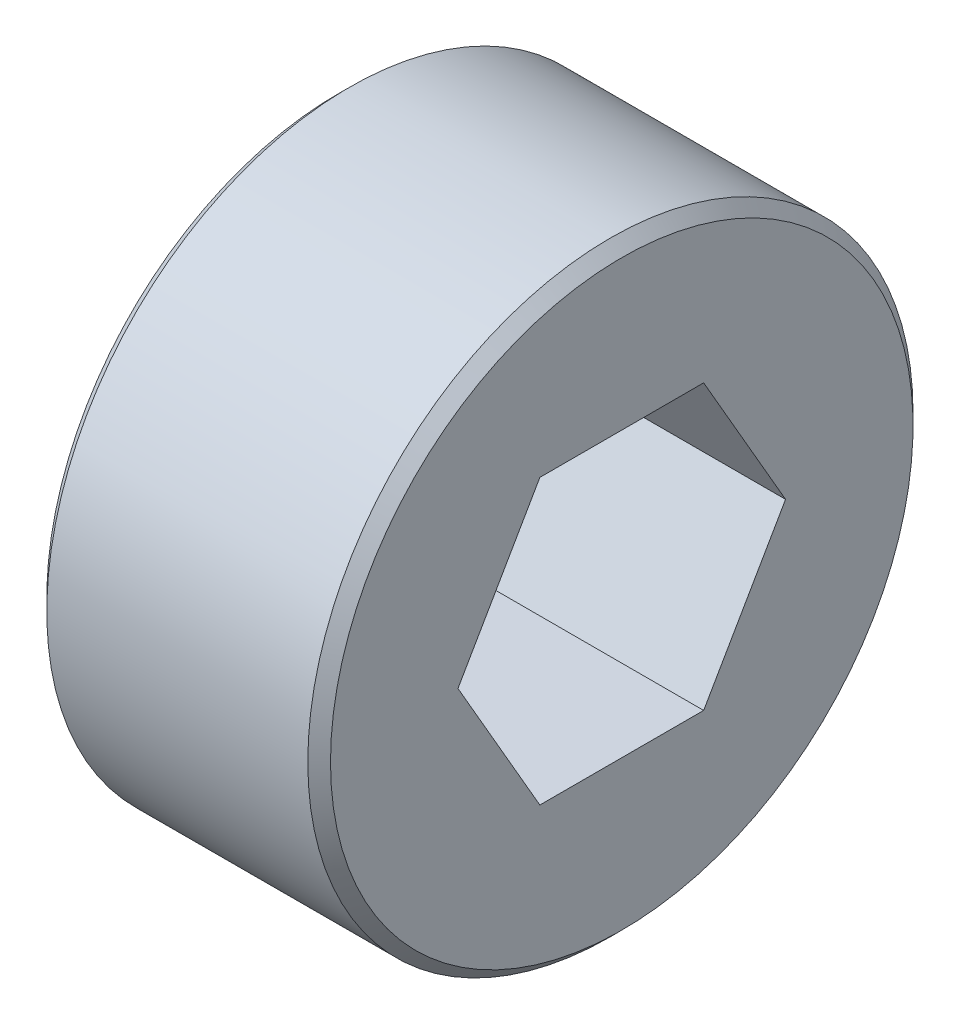
ISO-10303-21;
HEADER;
FILE_DESCRIPTION(('STEP AP214'),'2;1');
FILE_NAME('part.step','',(''),(''),'','','');
FILE_SCHEMA(('AUTOMOTIVE_DESIGN { 1 0 10303 214 1 1 1 1 }'));
ENDSEC;
DATA;
#1=APPLICATION_CONTEXT('core data for automotive mechanical design processes');
#2=APPLICATION_PROTOCOL_DEFINITION('international standard','automotive_design',2000,#1);
#3=PRODUCT_CONTEXT('',#1,'mechanical');
#4=PRODUCT('Part','Part','',(#3));
#5=PRODUCT_RELATED_PRODUCT_CATEGORY('part','',(#4));
#6=PRODUCT_DEFINITION_FORMATION('','',#4);
#7=PRODUCT_DEFINITION_CONTEXT('part definition',#1,'design');
#8=PRODUCT_DEFINITION('design','',#6,#7);
#9=PRODUCT_DEFINITION_SHAPE('','',#8);
#10=(LENGTH_UNIT() NAMED_UNIT(*) SI_UNIT(.MILLI.,.METRE.));
#11=(NAMED_UNIT(*) PLANE_ANGLE_UNIT() SI_UNIT($,.RADIAN.));
#12=(NAMED_UNIT(*) SI_UNIT($,.STERADIAN.) SOLID_ANGLE_UNIT());
#13=UNCERTAINTY_MEASURE_WITH_UNIT(LENGTH_MEASURE(1.E-05),#10,'distance_accuracy_value','');
#14=(GEOMETRIC_REPRESENTATION_CONTEXT(3) GLOBAL_UNCERTAINTY_ASSIGNED_CONTEXT((#13)) GLOBAL_UNIT_ASSIGNED_CONTEXT((#10,
#11,#12)) REPRESENTATION_CONTEXT('',''));
#15=CARTESIAN_POINT('',(0.,0.,0.));
#16=DIRECTION('',(0.,0.,1.));
#17=DIRECTION('',(1.,0.,0.));
#18=AXIS2_PLACEMENT_3D('',#15,#16,#17);
#19=CARTESIAN_POINT('',(790.078206956139,300.194333300496,0.));
#20=DIRECTION('',(1.,0.,0.));
#21=DIRECTION('',(0.,0.,-1.));
#22=AXIS2_PLACEMENT_3D('',#19,#20,#21);
#23=CONICAL_SURFACE('',#22,6.34999999987001,0.785398162502276);
#24=CARTESIAN_POINT('',(790.078206956082,300.194333300496,0.));
#25=DIRECTION('',(1.,0.,0.));
#26=DIRECTION('',(0.,0.,-1.));
#27=AXIS2_PLACEMENT_3D('',#24,#25,#26);
#28=CIRCLE('',#27,6.35000000000003);
#29=CARTESIAN_POINT('',(790.078206956082,300.194333300496,-6.35000000000003));
#30=VERTEX_POINT('',#29);
#31=EDGE_CURVE('E103',#30,#30,#28,.T.);
#32=ORIENTED_EDGE('',*,*,#31,.F.);
#33=EDGE_LOOP('',(#32));
#34=FACE_BOUND('',#33,.T.);
#35=CARTESIAN_POINT('',(789.824206955927,300.194333300496,0.));
#36=DIRECTION('',(1.,0.,0.));
#37=DIRECTION('',(0.,0.,-1.));
#38=AXIS2_PLACEMENT_3D('',#35,#36,#37);
#39=CIRCLE('',#38,6.0960000001134);
#40=CARTESIAN_POINT('',(789.824206955927,300.194333300496,-6.0960000001134));
#41=VERTEX_POINT('',#40);
#42=EDGE_CURVE('E21',#41,#41,#39,.F.);
#43=ORIENTED_EDGE('',*,*,#42,.F.);
#44=EDGE_LOOP('',(#43));
#45=FACE_BOUND('',#44,.T.);
#46=ADVANCED_FACE('F17',(#34,#45),#23,.T.);
#47=CARTESIAN_POINT('',(790.141706956082,300.194333300496,0.));
#48=DIRECTION('',(1.,0.,0.));
#49=DIRECTION('',(0.,0.,-1.));
#50=AXIS2_PLACEMENT_3D('',#47,#48,#49);
#51=CYLINDRICAL_SURFACE('',#50,6.35000000000003);
#52=CARTESIAN_POINT('',(790.205206956082,300.194333300496,0.));
#53=DIRECTION('',(1.,0.,0.));
#54=DIRECTION('',(0.,0.,-1.));
#55=AXIS2_PLACEMENT_3D('',#52,#53,#54);
#56=CIRCLE('',#55,6.35000000000002);
#57=CARTESIAN_POINT('',(790.205206956082,300.194333300496,-6.35000000000002));
#58=VERTEX_POINT('',#57);
#59=EDGE_CURVE('E88',#58,#58,#56,.T.);
#60=ORIENTED_EDGE('',*,*,#59,.F.);
#61=EDGE_LOOP('',(#60));
#62=FACE_BOUND('',#61,.T.);
#63=ORIENTED_EDGE('',*,*,#31,.T.);
#64=EDGE_LOOP('',(#63));
#65=FACE_BOUND('',#64,.T.);
#66=ADVANCED_FACE('F277',(#62,#65),#51,.T.);
#67=CARTESIAN_POINT('',(789.824206956082,303.369333300496,0.));
#68=DIRECTION('',(-1.,0.,0.));
#69=DIRECTION('',(0.,0.,1.));
#70=AXIS2_PLACEMENT_3D('',#67,#68,#69);
#71=PLANE('',#70);
#72=DIRECTION('',(0.,0.866025403784438,-0.5));
#73=VECTOR('',#72,1.);
#74=CARTESIAN_POINT('',(789.824206956082,300.194333300496,-5.49926131403119));
#75=LINE('',#74,#73);
#76=CARTESIAN_POINT('',(789.824206956082,295.431833300496,-2.7496306570156));
#77=VERTEX_POINT('',#76);
#78=CARTESIAN_POINT('',(789.824206956082,300.194333300496,-5.49926131403119));
#79=VERTEX_POINT('',#78);
#80=EDGE_CURVE('E69',#77,#79,#75,.T.);
#81=ORIENTED_EDGE('',*,*,#80,.T.);
#82=DIRECTION('',(0.,0.866025403784439,0.5));
#83=VECTOR('',#82,1.);
#84=CARTESIAN_POINT('',(789.824206956082,304.956833300496,-2.7496306570156));
#85=LINE('',#84,#83);
#86=CARTESIAN_POINT('',(789.824206956082,304.956833300496,-2.7496306570156));
#87=VERTEX_POINT('',#86);
#88=EDGE_CURVE('E71',#79,#87,#85,.T.);
#89=ORIENTED_EDGE('',*,*,#88,.T.);
#90=DIRECTION('',(0.,0.,1.));
#91=VECTOR('',#90,1.);
#92=CARTESIAN_POINT('',(789.824206956082,304.956833300496,2.7496306570156));
#93=LINE('',#92,#91);
#94=CARTESIAN_POINT('',(789.824206956082,304.956833300496,2.7496306570156));
#95=VERTEX_POINT('',#94);
#96=EDGE_CURVE('E75',#87,#95,#93,.T.);
#97=ORIENTED_EDGE('',*,*,#96,.T.);
#98=DIRECTION('',(0.,-0.866025403784438,0.5));
#99=VECTOR('',#98,1.);
#100=CARTESIAN_POINT('',(789.824206956082,300.194333300496,5.49926131403119));
#101=LINE('',#100,#99);
#102=CARTESIAN_POINT('',(789.824206956082,300.194333300496,5.49926131403119));
#103=VERTEX_POINT('',#102);
#104=EDGE_CURVE('E120',#95,#103,#101,.T.);
#105=ORIENTED_EDGE('',*,*,#104,.T.);
#106=DIRECTION('',(0.,-0.866025403784439,-0.5));
#107=VECTOR('',#106,1.);
#108=CARTESIAN_POINT('',(789.824206956082,295.431833300496,2.7496306570156));
#109=LINE('',#108,#107);
#110=CARTESIAN_POINT('',(789.824206956082,295.431833300496,2.7496306570156));
#111=VERTEX_POINT('',#110);
#112=EDGE_CURVE('E128',#103,#111,#109,.T.);
#113=ORIENTED_EDGE('',*,*,#112,.T.);
#114=DIRECTION('',(0.,0.,-1.));
#115=VECTOR('',#114,1.);
#116=CARTESIAN_POINT('',(789.824206956082,295.431833300496,-2.7496306570156));
#117=LINE('',#116,#115);
#118=EDGE_CURVE('E132',#111,#77,#117,.T.);
#119=ORIENTED_EDGE('',*,*,#118,.T.);
#120=EDGE_LOOP('',(#81,#89,#97,#105,#113,#119));
#121=FACE_BOUND('',#120,.T.);
#122=ORIENTED_EDGE('',*,*,#42,.T.);
#123=EDGE_LOOP('',(#122));
#124=FACE_BOUND('',#123,.T.);
#125=ADVANCED_FACE('F73',(#121,#124),#71,.T.);
#126=CARTESIAN_POINT('',(790.205206956082,300.194333300496,0.));
#127=DIRECTION('',(1.,0.,0.));
#128=DIRECTION('',(0.,0.,-1.));
#129=AXIS2_PLACEMENT_3D('',#126,#127,#128);
#130=TOROIDAL_SURFACE('',#129,6.60400000000014,0.253999999999998);
#131=CARTESIAN_POINT('',(790.459206956082,300.194333300496,0.));
#132=DIRECTION('',(1.,0.,0.));
#133=DIRECTION('',(0.,0.,-1.));
#134=AXIS2_PLACEMENT_3D('',#131,#132,#133);
#135=CIRCLE('',#134,6.604);
#136=CARTESIAN_POINT('',(790.459206956082,300.194333300496,-6.604));
#137=VERTEX_POINT('',#136);
#138=EDGE_CURVE('E114',#137,#137,#135,.T.);
#139=ORIENTED_EDGE('',*,*,#138,.F.);
#140=EDGE_LOOP('',(#139));
#141=FACE_BOUND('',#140,.T.);
#142=ORIENTED_EDGE('',*,*,#59,.T.);
#143=EDGE_LOOP('',(#142));
#144=FACE_BOUND('',#143,.T.);
#145=ADVANCED_FACE('F19',(#141,#144),#130,.F.);
#146=CARTESIAN_POINT('',(789.824206956082,304.956833300496,2.7496306570156));
#147=DIRECTION('',(0.,1.,0.));
#148=DIRECTION('',(0.,0.,1.));
#149=AXIS2_PLACEMENT_3D('',#146,#147,#148);
#150=PLANE('',#149);
#151=DIRECTION('',(1.,0.,0.));
#152=VECTOR('',#151,1.);
#153=CARTESIAN_POINT('',(789.824206956082,304.956833300496,2.7496306570156));
#154=LINE('',#153,#152);
#155=CARTESIAN_POINT('',(799.984206956082,304.956833300496,2.7496306570156));
#156=VERTEX_POINT('',#155);
#157=EDGE_CURVE('E86',#156,#95,#154,.F.);
#158=ORIENTED_EDGE('',*,*,#157,.T.);
#159=ORIENTED_EDGE('',*,*,#96,.F.);
#160=DIRECTION('',(1.,0.,0.));
#161=VECTOR('',#160,1.);
#162=CARTESIAN_POINT('',(789.824206956082,304.956833300496,-2.7496306570156));
#163=LINE('',#162,#161);
#164=CARTESIAN_POINT('',(799.984206956082,304.956833300496,-2.7496306570156));
#165=VERTEX_POINT('',#164);
#166=EDGE_CURVE('E80',#87,#165,#163,.T.);
#167=ORIENTED_EDGE('',*,*,#166,.T.);
#168=DIRECTION('',(0.,0.,-1.));
#169=VECTOR('',#168,1.);
#170=CARTESIAN_POINT('',(799.984206956082,304.956833300496,0.));
#171=LINE('',#170,#169);
#172=EDGE_CURVE('E116',#156,#165,#171,.T.);
#173=ORIENTED_EDGE('',*,*,#172,.F.);
#174=EDGE_LOOP('',(#158,#159,#167,#173));
#175=FACE_BOUND('',#174,.T.);
#176=ADVANCED_FACE('F83',(#175),#150,.F.);
#177=CARTESIAN_POINT('',(789.824206956082,304.956833300496,-2.7496306570156));
#178=DIRECTION('',(0.,0.5,-0.866025403784439));
#179=DIRECTION('',(0.,0.866025403784439,0.5));
#180=AXIS2_PLACEMENT_3D('',#177,#178,#179);
#181=PLANE('',#180);
#182=ORIENTED_EDGE('',*,*,#166,.F.);
#183=ORIENTED_EDGE('',*,*,#88,.F.);
#184=DIRECTION('',(1.,0.,0.));
#185=VECTOR('',#184,1.);
#186=CARTESIAN_POINT('',(789.824206956082,300.194333300496,-5.49926131403119));
#187=LINE('',#186,#185);
#188=CARTESIAN_POINT('',(799.984206956082,300.194333300496,-5.49926131403119));
#189=VERTEX_POINT('',#188);
#190=EDGE_CURVE('E95',#79,#189,#187,.T.);
#191=ORIENTED_EDGE('',*,*,#190,.T.);
#192=DIRECTION('',(0.,-0.866025403784438,-0.5));
#193=VECTOR('',#192,1.);
#194=CARTESIAN_POINT('',(799.984206956082,304.956833300496,-2.7496306570156));
#195=LINE('',#194,#193);
#196=EDGE_CURVE('E92',#165,#189,#195,.T.);
#197=ORIENTED_EDGE('',*,*,#196,.F.);
#198=EDGE_LOOP('',(#182,#183,#191,#197));
#199=FACE_BOUND('',#198,.T.);
#200=ADVANCED_FACE('F90',(#199),#181,.F.);
#201=CARTESIAN_POINT('',(789.824206956082,300.194333300496,-5.49926131403119));
#202=DIRECTION('',(0.,-0.5,-0.866025403784438));
#203=DIRECTION('',(0.,0.866025403784438,-0.5));
#204=AXIS2_PLACEMENT_3D('',#201,#202,#203);
#205=PLANE('',#204);
#206=ORIENTED_EDGE('',*,*,#190,.F.);
#207=ORIENTED_EDGE('',*,*,#80,.F.);
#208=DIRECTION('',(1.,0.,0.));
#209=VECTOR('',#208,1.);
#210=CARTESIAN_POINT('',(789.824206956082,295.431833300496,-2.7496306570156));
#211=LINE('',#210,#209);
#212=CARTESIAN_POINT('',(799.984206956082,295.431833300496,-2.7496306570156));
#213=VERTEX_POINT('',#212);
#214=EDGE_CURVE('E130',#77,#213,#211,.T.);
#215=ORIENTED_EDGE('',*,*,#214,.T.);
#216=DIRECTION('',(0.,-0.866025403784438,0.5));
#217=VECTOR('',#216,1.);
#218=CARTESIAN_POINT('',(799.984206956082,300.194333300496,-5.49926131403119));
#219=LINE('',#218,#217);
#220=EDGE_CURVE('E136',#189,#213,#219,.T.);
#221=ORIENTED_EDGE('',*,*,#220,.F.);
#222=EDGE_LOOP('',(#206,#207,#215,#221));
#223=FACE_BOUND('',#222,.T.);
#224=ADVANCED_FACE('F137',(#223),#205,.F.);
#225=CARTESIAN_POINT('',(789.824206956082,295.431833300496,-2.7496306570156));
#226=DIRECTION('',(0.,-1.,0.));
#227=DIRECTION('',(0.,0.,-1.));
#228=AXIS2_PLACEMENT_3D('',#225,#226,#227);
#229=PLANE('',#228);
#230=ORIENTED_EDGE('',*,*,#214,.F.);
#231=ORIENTED_EDGE('',*,*,#118,.F.);
#232=DIRECTION('',(1.,0.,0.));
#233=VECTOR('',#232,1.);
#234=CARTESIAN_POINT('',(789.824206956082,295.431833300496,2.7496306570156));
#235=LINE('',#234,#233);
#236=CARTESIAN_POINT('',(799.984206956082,295.431833300496,2.7496306570156));
#237=VERTEX_POINT('',#236);
#238=EDGE_CURVE('E126',#111,#237,#235,.T.);
#239=ORIENTED_EDGE('',*,*,#238,.T.);
#240=DIRECTION('',(0.,0.,-1.));
#241=VECTOR('',#240,1.);
#242=CARTESIAN_POINT('',(799.984206956082,295.431833300496,0.));
#243=LINE('',#242,#241);
#244=EDGE_CURVE('E142',#213,#237,#243,.F.);
#245=ORIENTED_EDGE('',*,*,#244,.F.);
#246=EDGE_LOOP('',(#230,#231,#239,#245));
#247=FACE_BOUND('',#246,.T.);
#248=ADVANCED_FACE('F227',(#247),#229,.F.);
#249=CARTESIAN_POINT('',(789.824206956082,295.431833300496,2.7496306570156));
#250=DIRECTION('',(0.,-0.5,0.866025403784439));
#251=DIRECTION('',(0.,-0.866025403784439,-0.5));
#252=AXIS2_PLACEMENT_3D('',#249,#250,#251);
#253=PLANE('',#252);
#254=ORIENTED_EDGE('',*,*,#238,.F.);
#255=ORIENTED_EDGE('',*,*,#112,.F.);
#256=DIRECTION('',(1.,0.,0.));
#257=VECTOR('',#256,1.);
#258=CARTESIAN_POINT('',(789.824206956082,300.194333300496,5.49926131403119));
#259=LINE('',#258,#257);
#260=CARTESIAN_POINT('',(799.984206956082,300.194333300496,5.49926131403119));
#261=VERTEX_POINT('',#260);
#262=EDGE_CURVE('E36',#103,#261,#259,.T.);
#263=ORIENTED_EDGE('',*,*,#262,.T.);
#264=DIRECTION('',(0.,0.866025403784438,0.5));
#265=VECTOR('',#264,1.);
#266=CARTESIAN_POINT('',(799.984206956082,295.431833300496,2.7496306570156));
#267=LINE('',#266,#265);
#268=EDGE_CURVE('E150',#237,#261,#267,.T.);
#269=ORIENTED_EDGE('',*,*,#268,.F.);
#270=EDGE_LOOP('',(#254,#255,#263,#269));
#271=FACE_BOUND('',#270,.T.);
#272=ADVANCED_FACE('F179',(#271),#253,.F.);
#273=CARTESIAN_POINT('',(789.824206956082,300.194333300496,5.49926131403119));
#274=DIRECTION('',(0.,0.5,0.866025403784438));
#275=DIRECTION('',(0.,-0.866025403784438,0.5));
#276=AXIS2_PLACEMENT_3D('',#273,#274,#275);
#277=PLANE('',#276);
#278=ORIENTED_EDGE('',*,*,#262,.F.);
#279=ORIENTED_EDGE('',*,*,#104,.F.);
#280=ORIENTED_EDGE('',*,*,#157,.F.);
#281=DIRECTION('',(0.,0.866025403784438,-0.5));
#282=VECTOR('',#281,1.);
#283=CARTESIAN_POINT('',(799.984206956082,300.194333300496,5.49926131403119));
#284=LINE('',#283,#282);
#285=EDGE_CURVE('E113',#261,#156,#284,.T.);
#286=ORIENTED_EDGE('',*,*,#285,.F.);
#287=EDGE_LOOP('',(#278,#279,#280,#286));
#288=FACE_BOUND('',#287,.T.);
#289=ADVANCED_FACE('F171',(#288),#277,.F.);
#290=CARTESIAN_POINT('',(790.459206956082,308.449333300496,0.));
#291=DIRECTION('',(-1.,0.,0.));
#292=DIRECTION('',(0.,0.,1.));
#293=AXIS2_PLACEMENT_3D('',#290,#291,#292);
#294=PLANE('',#293);
#295=ORIENTED_EDGE('',*,*,#138,.T.);
#296=EDGE_LOOP('',(#295));
#297=FACE_BOUND('',#296,.T.);
#298=CARTESIAN_POINT('',(790.459206955911,300.194333300496,0.));
#299=DIRECTION('',(1.,0.,0.));
#300=DIRECTION('',(0.,0.,-1.));
#301=AXIS2_PLACEMENT_3D('',#298,#299,#300);
#302=CIRCLE('',#301,9.77900000017085);
#303=CARTESIAN_POINT('',(790.459206955911,300.194333300496,-9.77900000017085));
#304=VERTEX_POINT('',#303);
#305=EDGE_CURVE('E111',#304,#304,#302,.T.);
#306=ORIENTED_EDGE('',*,*,#305,.F.);
#307=EDGE_LOOP('',(#306));
#308=FACE_BOUND('',#307,.T.);
#309=ADVANCED_FACE('F169',(#297,#308),#294,.T.);
#310=CARTESIAN_POINT('',(799.984206956082,305.274333300496,0.));
#311=DIRECTION('',(1.,0.,0.));
#312=DIRECTION('',(0.,0.,-1.));
#313=AXIS2_PLACEMENT_3D('',#310,#311,#312);
#314=PLANE('',#313);
#315=ORIENTED_EDGE('',*,*,#268,.T.);
#316=ORIENTED_EDGE('',*,*,#285,.T.);
#317=ORIENTED_EDGE('',*,*,#172,.T.);
#318=ORIENTED_EDGE('',*,*,#196,.T.);
#319=ORIENTED_EDGE('',*,*,#220,.T.);
#320=ORIENTED_EDGE('',*,*,#244,.T.);
#321=EDGE_LOOP('',(#315,#316,#317,#318,#319,#320));
#322=FACE_BOUND('',#321,.T.);
#323=CARTESIAN_POINT('',(799.984206956253,300.194333300496,0.));
#324=DIRECTION('',(-1.,0.,0.));
#325=DIRECTION('',(0.,0.,1.));
#326=AXIS2_PLACEMENT_3D('',#323,#324,#325);
#327=CIRCLE('',#326,9.77900000017096);
#328=CARTESIAN_POINT('',(799.984206956253,300.194333300496,9.77900000017096));
#329=VERTEX_POINT('',#328);
#330=EDGE_CURVE('E108',#329,#329,#327,.T.);
#331=ORIENTED_EDGE('',*,*,#330,.F.);
#332=EDGE_LOOP('',(#331));
#333=FACE_BOUND('',#332,.T.);
#334=ADVANCED_FACE('F145',(#322,#333),#314,.T.);
#335=CARTESIAN_POINT('',(790.840206956253,300.194333300496,0.));
#336=DIRECTION('',(1.,0.,0.));
#337=DIRECTION('',(0.,0.,-1.));
#338=AXIS2_PLACEMENT_3D('',#335,#336,#337);
#339=CONICAL_SURFACE('',#338,10.1599999998289,0.785398162500018);
#340=CARTESIAN_POINT('',(790.840206956082,300.194333300496,0.));
#341=DIRECTION('',(1.,0.,0.));
#342=DIRECTION('',(0.,0.,-1.));
#343=AXIS2_PLACEMENT_3D('',#340,#341,#342);
#344=CIRCLE('',#343,10.16);
#345=CARTESIAN_POINT('',(790.840206956082,300.194333300496,-10.16));
#346=VERTEX_POINT('',#345);
#347=EDGE_CURVE('E27',#346,#346,#344,.T.);
#348=ORIENTED_EDGE('',*,*,#347,.F.);
#349=EDGE_LOOP('',(#348));
#350=FACE_BOUND('',#349,.T.);
#351=ORIENTED_EDGE('',*,*,#305,.T.);
#352=EDGE_LOOP('',(#351));
#353=FACE_BOUND('',#352,.T.);
#354=ADVANCED_FACE('F162',(#350,#353),#339,.T.);
#355=CARTESIAN_POINT('',(799.603206955911,300.194333300496,0.));
#356=DIRECTION('',(-1.,0.,0.));
#357=DIRECTION('',(0.,0.,1.));
#358=AXIS2_PLACEMENT_3D('',#355,#356,#357);
#359=CONICAL_SURFACE('',#358,10.159999999829,0.785398162500018);
#360=ORIENTED_EDGE('',*,*,#330,.T.);
#361=EDGE_LOOP('',(#360));
#362=FACE_BOUND('',#361,.T.);
#363=CARTESIAN_POINT('',(799.603206956082,300.194333300496,0.));
#364=DIRECTION('',(1.,0.,0.));
#365=DIRECTION('',(0.,0.,-1.));
#366=AXIS2_PLACEMENT_3D('',#363,#364,#365);
#367=CIRCLE('',#366,10.16);
#368=CARTESIAN_POINT('',(799.603206956082,300.194333300496,-10.16));
#369=VERTEX_POINT('',#368);
#370=EDGE_CURVE('E11',#369,#369,#367,.F.);
#371=ORIENTED_EDGE('',*,*,#370,.F.);
#372=EDGE_LOOP('',(#371));
#373=FACE_BOUND('',#372,.T.);
#374=ADVANCED_FACE('F165',(#362,#373),#359,.T.);
#375=CARTESIAN_POINT('',(795.221706956082,300.194333300496,0.));
#376=DIRECTION('',(1.,0.,0.));
#377=DIRECTION('',(0.,0.,-1.));
#378=AXIS2_PLACEMENT_3D('',#375,#376,#377);
#379=CYLINDRICAL_SURFACE('',#378,10.16);
#380=ORIENTED_EDGE('',*,*,#370,.T.);
#381=EDGE_LOOP('',(#380));
#382=FACE_BOUND('',#381,.T.);
#383=ORIENTED_EDGE('',*,*,#347,.T.);
#384=EDGE_LOOP('',(#383));
#385=FACE_BOUND('',#384,.T.);
#386=ADVANCED_FACE('F160',(#382,#385),#379,.T.);
#387=CLOSED_SHELL('',(#46,#66,#125,#145,#176,#200,#224,#248,#272,#289,#309,#334,#354,#374,#386));
#388=MANIFOLD_SOLID_BREP('B1',#387);
#389=ADVANCED_BREP_SHAPE_REPRESENTATION('',(#18,#388),#14);
#390=SHAPE_DEFINITION_REPRESENTATION(#9,#389);
ENDSEC;
END-ISO-10303-21;
